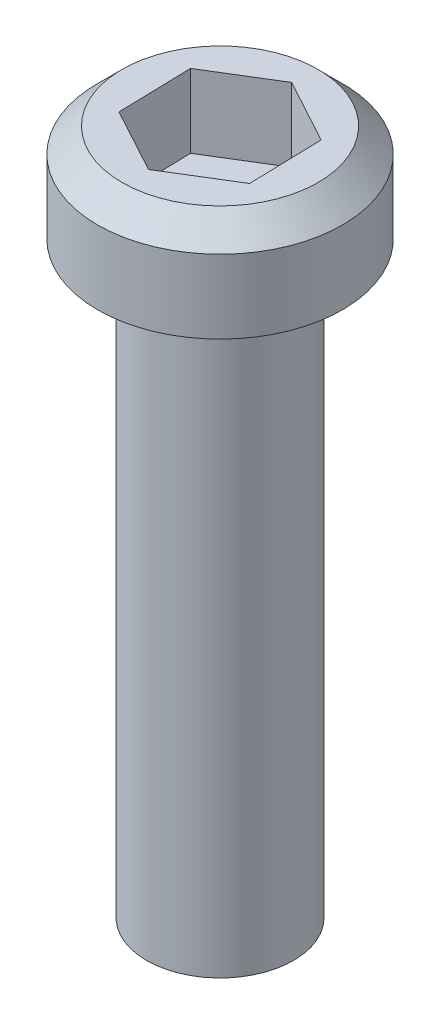
ISO-10303-21;
HEADER;
FILE_DESCRIPTION(('STEP AP214'),'2;1');
FILE_NAME('part.step','',(''),(''),'','','');
FILE_SCHEMA(('AUTOMOTIVE_DESIGN { 1 0 10303 214 1 1 1 1 }'));
ENDSEC;
DATA;
#1=APPLICATION_CONTEXT('core data for automotive mechanical design processes');
#2=APPLICATION_PROTOCOL_DEFINITION('international standard','automotive_design',2000,#1);
#3=PRODUCT_CONTEXT('',#1,'mechanical');
#4=PRODUCT('Part','Part','',(#3));
#5=PRODUCT_RELATED_PRODUCT_CATEGORY('part','',(#4));
#6=PRODUCT_DEFINITION_FORMATION('','',#4);
#7=PRODUCT_DEFINITION_CONTEXT('part definition',#1,'design');
#8=PRODUCT_DEFINITION('design','',#6,#7);
#9=PRODUCT_DEFINITION_SHAPE('','',#8);
#10=(LENGTH_UNIT() NAMED_UNIT(*) SI_UNIT(.MILLI.,.METRE.));
#11=(NAMED_UNIT(*) PLANE_ANGLE_UNIT() SI_UNIT($,.RADIAN.));
#12=(NAMED_UNIT(*) SI_UNIT($,.STERADIAN.) SOLID_ANGLE_UNIT());
#13=UNCERTAINTY_MEASURE_WITH_UNIT(LENGTH_MEASURE(1.E-05),#10,'distance_accuracy_value','');
#14=(GEOMETRIC_REPRESENTATION_CONTEXT(3) GLOBAL_UNCERTAINTY_ASSIGNED_CONTEXT((#13)) GLOBAL_UNIT_ASSIGNED_CONTEXT((#10,
#11,#12)) REPRESENTATION_CONTEXT('',''));
#15=CARTESIAN_POINT('',(0.,0.,0.));
#16=DIRECTION('',(0.,0.,1.));
#17=DIRECTION('',(1.,0.,0.));
#18=AXIS2_PLACEMENT_3D('',#15,#16,#17);
#19=CARTESIAN_POINT('',(-74.5378388677649,-12.,-155.627071659531));
#20=DIRECTION('',(0.,1.,0.));
#21=DIRECTION('',(0.,0.,1.));
#22=AXIS2_PLACEMENT_3D('',#19,#20,#21);
#23=CYLINDRICAL_SURFACE('',#22,1.50000000000001);
#24=CARTESIAN_POINT('',(-74.5378388677649,-12.,-155.627071659531));
#25=DIRECTION('',(0.,1.,0.));
#26=DIRECTION('',(0.,0.,1.));
#27=AXIS2_PLACEMENT_3D('',#24,#25,#26);
#28=CIRCLE('',#27,1.50000000000001);
#29=CARTESIAN_POINT('',(-74.5378388677649,-12.,-154.127071659531));
#30=VERTEX_POINT('',#29);
#31=EDGE_CURVE('E146',#30,#30,#28,.T.);
#32=ORIENTED_EDGE('',*,*,#31,.T.);
#33=EDGE_LOOP('',(#32));
#34=FACE_BOUND('',#33,.T.);
#35=CARTESIAN_POINT('',(-74.5378388677649,0.,-155.627071659531));
#36=DIRECTION('',(0.,1.,0.));
#37=DIRECTION('',(0.,0.,1.));
#38=AXIS2_PLACEMENT_3D('',#35,#36,#37);
#39=CIRCLE('',#38,1.50000000000001);
#40=CARTESIAN_POINT('',(-74.5378388677649,0.,-154.127071659531));
#41=VERTEX_POINT('',#40);
#42=EDGE_CURVE('E145',#41,#41,#39,.T.);
#43=ORIENTED_EDGE('',*,*,#42,.F.);
#44=EDGE_LOOP('',(#43));
#45=FACE_BOUND('',#44,.T.);
#46=ADVANCED_FACE('F34',(#34,#45),#23,.T.);
#47=CARTESIAN_POINT('',(-74.5378388677649,-12.,-155.627071659531));
#48=DIRECTION('',(0.,1.,0.));
#49=DIRECTION('',(0.,0.,1.));
#50=AXIS2_PLACEMENT_3D('',#47,#48,#49);
#51=PLANE('',#50);
#52=ORIENTED_EDGE('',*,*,#31,.F.);
#53=EDGE_LOOP('',(#52));
#54=FACE_BOUND('',#53,.T.);
#55=ADVANCED_FACE('F169',(#54),#51,.F.);
#56=CARTESIAN_POINT('',(-74.5378388677649,2.,-155.627071659531));
#57=DIRECTION('',(0.,-1.,0.));
#58=DIRECTION('',(0.,0.,-1.));
#59=AXIS2_PLACEMENT_3D('',#56,#57,#58);
#60=CYLINDRICAL_SURFACE('',#59,2.50000000000001);
#61=CARTESIAN_POINT('',(-74.5378388677649,1.5,-155.627071659531));
#62=DIRECTION('',(0.,1.,0.));
#63=DIRECTION('',(0.,0.,1.));
#64=AXIS2_PLACEMENT_3D('',#61,#62,#63);
#65=CIRCLE('',#64,2.50000000000001);
#66=CARTESIAN_POINT('',(-74.5378388677649,1.5,-153.127071659531));
#67=VERTEX_POINT('',#66);
#68=EDGE_CURVE('E11',#67,#67,#65,.F.);
#69=ORIENTED_EDGE('',*,*,#68,.T.);
#70=EDGE_LOOP('',(#69));
#71=FACE_BOUND('',#70,.T.);
#72=CARTESIAN_POINT('',(-74.5378388677649,0.,-155.627071659531));
#73=DIRECTION('',(0.,1.,0.));
#74=DIRECTION('',(0.,0.,1.));
#75=AXIS2_PLACEMENT_3D('',#72,#73,#74);
#76=CIRCLE('',#75,2.50000000000001);
#77=CARTESIAN_POINT('',(-74.5378388677649,0.,-153.127071659531));
#78=VERTEX_POINT('',#77);
#79=EDGE_CURVE('E137',#78,#78,#76,.T.);
#80=ORIENTED_EDGE('',*,*,#79,.T.);
#81=EDGE_LOOP('',(#80));
#82=FACE_BOUND('',#81,.T.);
#83=ADVANCED_FACE('F174',(#71,#82),#60,.T.);
#84=CARTESIAN_POINT('',(-74.5378388677649,2.,-155.627071659531));
#85=DIRECTION('',(0.,1.,0.));
#86=DIRECTION('',(0.,0.,1.));
#87=AXIS2_PLACEMENT_3D('',#84,#85,#86);
#88=PLANE('',#87);
#89=DIRECTION('',(0.852695960121091,0.,-0.522407503385213));
#90=VECTOR('',#89,1.);
#91=CARTESIAN_POINT('',(-74.4987335842669,2.,-154.127581487238));
#92=LINE('',#91,#90);
#93=CARTESIAN_POINT('',(-74.4987335842669,2.,-154.127581487238));
#94=VERTEX_POINT('',#93);
#95=CARTESIAN_POINT('',(-73.2196896440853,2.,-154.911192742316));
#96=VERTEX_POINT('',#95);
#97=EDGE_CURVE('E50',#94,#96,#92,.T.);
#98=ORIENTED_EDGE('',*,*,#97,.F.);
#99=DIRECTION('',(0.878766149119737,0.,0.477252611476635));
#100=VECTOR('',#99,1.);
#101=CARTESIAN_POINT('',(-75.8168828079465,2.,-154.843460404453));
#102=LINE('',#101,#100);
#103=CARTESIAN_POINT('',(-75.8168828079465,2.,-154.843460404453));
#104=VERTEX_POINT('',#103);
#105=EDGE_CURVE('E133',#104,#94,#102,.T.);
#106=ORIENTED_EDGE('',*,*,#105,.F.);
#107=DIRECTION('',(0.0260701889986576,0.,0.999660114861834));
#108=VECTOR('',#107,1.);
#109=CARTESIAN_POINT('',(-75.8559880914445,2.,-156.342950576746));
#110=LINE('',#109,#108);
#111=CARTESIAN_POINT('',(-75.8559880914445,2.,-156.342950576746));
#112=VERTEX_POINT('',#111);
#113=EDGE_CURVE('E131',#112,#104,#110,.T.);
#114=ORIENTED_EDGE('',*,*,#113,.F.);
#115=DIRECTION('',(-0.852695960121096,0.,0.522407503385203));
#116=VECTOR('',#115,1.);
#117=CARTESIAN_POINT('',(-74.5769441512629,2.,-157.126561831824));
#118=LINE('',#117,#116);
#119=CARTESIAN_POINT('',(-74.5769441512629,2.,-157.126561831824));
#120=VERTEX_POINT('',#119);
#121=EDGE_CURVE('E98',#120,#112,#118,.T.);
#122=ORIENTED_EDGE('',*,*,#121,.F.);
#123=DIRECTION('',(-0.878766149119749,0.,-0.477252611476613));
#124=VECTOR('',#123,1.);
#125=CARTESIAN_POINT('',(-73.2587949275833,2.,-156.410682914609));
#126=LINE('',#125,#124);
#127=CARTESIAN_POINT('',(-73.2587949275833,2.,-156.410682914609));
#128=VERTEX_POINT('',#127);
#129=EDGE_CURVE('E127',#128,#120,#126,.T.);
#130=ORIENTED_EDGE('',*,*,#129,.F.);
#131=DIRECTION('',(-0.0260701889986484,0.,-0.999660114861834));
#132=VECTOR('',#131,1.);
#133=CARTESIAN_POINT('',(-73.2196896440853,2.,-154.911192742316));
#134=LINE('',#133,#132);
#135=EDGE_CURVE('E124',#96,#128,#134,.T.);
#136=ORIENTED_EDGE('',*,*,#135,.F.);
#137=EDGE_LOOP('',(#98,#106,#114,#122,#130,#136));
#138=FACE_BOUND('',#137,.T.);
#139=CARTESIAN_POINT('',(-74.5378388677649,2.,-155.627071659531));
#140=DIRECTION('',(0.,1.,0.));
#141=DIRECTION('',(0.,0.,1.));
#142=AXIS2_PLACEMENT_3D('',#139,#140,#141);
#143=CIRCLE('',#142,2.);
#144=CARTESIAN_POINT('',(-74.5378388677649,2.,-153.627071659531));
#145=VERTEX_POINT('',#144);
#146=EDGE_CURVE('E43',#145,#145,#143,.T.);
#147=ORIENTED_EDGE('',*,*,#146,.T.);
#148=EDGE_LOOP('',(#147));
#149=FACE_BOUND('',#148,.T.);
#150=ADVANCED_FACE('F153',(#138,#149),#88,.T.);
#151=CARTESIAN_POINT('',(-74.5378388677649,0.,-155.627071659531));
#152=DIRECTION('',(0.,1.,0.));
#153=DIRECTION('',(0.,0.,1.));
#154=AXIS2_PLACEMENT_3D('',#151,#152,#153);
#155=PLANE('',#154);
#156=ORIENTED_EDGE('',*,*,#42,.T.);
#157=EDGE_LOOP('',(#156));
#158=FACE_BOUND('',#157,.T.);
#159=ORIENTED_EDGE('',*,*,#79,.F.);
#160=EDGE_LOOP('',(#159));
#161=FACE_BOUND('',#160,.T.);
#162=ADVANCED_FACE('F157',(#158,#161),#155,.F.);
#163=CARTESIAN_POINT('',(-74.5378388677649,2.,-155.627071659531));
#164=DIRECTION('',(0.,-1.,0.));
#165=DIRECTION('',(0.,0.,-1.));
#166=AXIS2_PLACEMENT_3D('',#163,#164,#165);
#167=CONICAL_SURFACE('',#166,2.,0.785398163397459);
#168=ORIENTED_EDGE('',*,*,#68,.F.);
#169=EDGE_LOOP('',(#168));
#170=FACE_BOUND('',#169,.T.);
#171=ORIENTED_EDGE('',*,*,#146,.F.);
#172=EDGE_LOOP('',(#171));
#173=FACE_BOUND('',#172,.T.);
#174=ADVANCED_FACE('F37',(#170,#173),#167,.T.);
#175=CARTESIAN_POINT('',(-74.4987335842669,0.5,-154.127581487238));
#176=DIRECTION('',(0.522407503385213,0.,0.852695960121091));
#177=DIRECTION('',(0.852695960121091,0.,-0.522407503385213));
#178=AXIS2_PLACEMENT_3D('',#175,#176,#177);
#179=PLANE('',#178);
#180=ORIENTED_EDGE('',*,*,#97,.T.);
#181=DIRECTION('',(0.,1.,0.));
#182=VECTOR('',#181,1.);
#183=CARTESIAN_POINT('',(-73.2196896440853,0.5,-154.911192742316));
#184=LINE('',#183,#182);
#185=CARTESIAN_POINT('',(-73.2196896440853,0.5,-154.911192742316));
#186=VERTEX_POINT('',#185);
#187=EDGE_CURVE('E80',#186,#96,#184,.T.);
#188=ORIENTED_EDGE('',*,*,#187,.F.);
#189=DIRECTION('',(0.852695960121091,0.,-0.522407503385213));
#190=VECTOR('',#189,1.);
#191=CARTESIAN_POINT('',(-74.4987335842669,0.5,-154.127581487238));
#192=LINE('',#191,#190);
#193=CARTESIAN_POINT('',(-74.4987335842669,0.5,-154.127581487238));
#194=VERTEX_POINT('',#193);
#195=EDGE_CURVE('E135',#194,#186,#192,.T.);
#196=ORIENTED_EDGE('',*,*,#195,.F.);
#197=DIRECTION('',(0.,1.,0.));
#198=VECTOR('',#197,1.);
#199=CARTESIAN_POINT('',(-74.4987335842669,0.5,-154.127581487238));
#200=LINE('',#199,#198);
#201=EDGE_CURVE('E58',#194,#94,#200,.T.);
#202=ORIENTED_EDGE('',*,*,#201,.T.);
#203=EDGE_LOOP('',(#180,#188,#196,#202));
#204=FACE_BOUND('',#203,.T.);
#205=ADVANCED_FACE('F156',(#204),#179,.F.);
#206=CARTESIAN_POINT('',(-75.8168828079465,0.5,-154.843460404453));
#207=DIRECTION('',(-0.477252611476635,0.,0.878766149119737));
#208=DIRECTION('',(0.878766149119737,0.,0.477252611476635));
#209=AXIS2_PLACEMENT_3D('',#206,#207,#208);
#210=PLANE('',#209);
#211=ORIENTED_EDGE('',*,*,#105,.T.);
#212=ORIENTED_EDGE('',*,*,#201,.F.);
#213=DIRECTION('',(0.878766149119737,0.,0.477252611476635));
#214=VECTOR('',#213,1.);
#215=CARTESIAN_POINT('',(-75.8168828079465,0.5,-154.843460404453));
#216=LINE('',#215,#214);
#217=CARTESIAN_POINT('',(-75.8168828079465,0.5,-154.843460404453));
#218=VERTEX_POINT('',#217);
#219=EDGE_CURVE('E110',#218,#194,#216,.T.);
#220=ORIENTED_EDGE('',*,*,#219,.F.);
#221=DIRECTION('',(0.,1.,0.));
#222=VECTOR('',#221,1.);
#223=CARTESIAN_POINT('',(-75.8168828079465,0.5,-154.843460404453));
#224=LINE('',#223,#222);
#225=EDGE_CURVE('E102',#218,#104,#224,.T.);
#226=ORIENTED_EDGE('',*,*,#225,.T.);
#227=EDGE_LOOP('',(#211,#212,#220,#226));
#228=FACE_BOUND('',#227,.T.);
#229=ADVANCED_FACE('F163',(#228),#210,.F.);
#230=CARTESIAN_POINT('',(-75.8559880914445,0.5,-156.342950576746));
#231=DIRECTION('',(-0.999660114861834,0.,0.0260701889986576));
#232=DIRECTION('',(0.0260701889986576,0.,0.999660114861834));
#233=AXIS2_PLACEMENT_3D('',#230,#231,#232);
#234=PLANE('',#233);
#235=ORIENTED_EDGE('',*,*,#113,.T.);
#236=ORIENTED_EDGE('',*,*,#225,.F.);
#237=DIRECTION('',(0.0260701889986576,0.,0.999660114861834));
#238=VECTOR('',#237,1.);
#239=CARTESIAN_POINT('',(-75.8559880914445,0.5,-156.342950576746));
#240=LINE('',#239,#238);
#241=CARTESIAN_POINT('',(-75.8559880914445,0.5,-156.342950576746));
#242=VERTEX_POINT('',#241);
#243=EDGE_CURVE('E106',#242,#218,#240,.T.);
#244=ORIENTED_EDGE('',*,*,#243,.F.);
#245=DIRECTION('',(0.,1.,0.));
#246=VECTOR('',#245,1.);
#247=CARTESIAN_POINT('',(-75.8559880914445,0.5,-156.342950576746));
#248=LINE('',#247,#246);
#249=EDGE_CURVE('E91',#242,#112,#248,.T.);
#250=ORIENTED_EDGE('',*,*,#249,.T.);
#251=EDGE_LOOP('',(#235,#236,#244,#250));
#252=FACE_BOUND('',#251,.T.);
#253=ADVANCED_FACE('F107',(#252),#234,.F.);
#254=CARTESIAN_POINT('',(-74.5769441512629,0.5,-157.126561831824));
#255=DIRECTION('',(-0.522407503385204,0.,-0.852695960121096));
#256=DIRECTION('',(-0.852695960121096,0.,0.522407503385204));
#257=AXIS2_PLACEMENT_3D('',#254,#255,#256);
#258=PLANE('',#257);
#259=ORIENTED_EDGE('',*,*,#121,.T.);
#260=ORIENTED_EDGE('',*,*,#249,.F.);
#261=DIRECTION('',(-0.852695960121096,0.,0.522407503385203));
#262=VECTOR('',#261,1.);
#263=CARTESIAN_POINT('',(-74.5769441512629,0.5,-157.126561831824));
#264=LINE('',#263,#262);
#265=CARTESIAN_POINT('',(-74.5769441512629,0.5,-157.126561831824));
#266=VERTEX_POINT('',#265);
#267=EDGE_CURVE('E95',#266,#242,#264,.T.);
#268=ORIENTED_EDGE('',*,*,#267,.F.);
#269=DIRECTION('',(0.,1.,0.));
#270=VECTOR('',#269,1.);
#271=CARTESIAN_POINT('',(-74.5769441512629,0.5,-157.126561831824));
#272=LINE('',#271,#270);
#273=EDGE_CURVE('E103',#266,#120,#272,.T.);
#274=ORIENTED_EDGE('',*,*,#273,.T.);
#275=EDGE_LOOP('',(#259,#260,#268,#274));
#276=FACE_BOUND('',#275,.T.);
#277=ADVANCED_FACE('F93',(#276),#258,.F.);
#278=CARTESIAN_POINT('',(-73.2587949275833,0.5,-156.410682914609));
#279=DIRECTION('',(0.477252611476613,0.,-0.878766149119749));
#280=DIRECTION('',(-0.878766149119749,0.,-0.477252611476613));
#281=AXIS2_PLACEMENT_3D('',#278,#279,#280);
#282=PLANE('',#281);
#283=ORIENTED_EDGE('',*,*,#129,.T.);
#284=ORIENTED_EDGE('',*,*,#273,.F.);
#285=DIRECTION('',(-0.878766149119749,0.,-0.477252611476613));
#286=VECTOR('',#285,1.);
#287=CARTESIAN_POINT('',(-73.2587949275833,0.5,-156.410682914609));
#288=LINE('',#287,#286);
#289=CARTESIAN_POINT('',(-73.2587949275833,0.5,-156.410682914609));
#290=VERTEX_POINT('',#289);
#291=EDGE_CURVE('E116',#290,#266,#288,.T.);
#292=ORIENTED_EDGE('',*,*,#291,.F.);
#293=DIRECTION('',(0.,1.,0.));
#294=VECTOR('',#293,1.);
#295=CARTESIAN_POINT('',(-73.2587949275833,0.5,-156.410682914609));
#296=LINE('',#295,#294);
#297=EDGE_CURVE('E140',#290,#128,#296,.T.);
#298=ORIENTED_EDGE('',*,*,#297,.T.);
#299=EDGE_LOOP('',(#283,#284,#292,#298));
#300=FACE_BOUND('',#299,.T.);
#301=ADVANCED_FACE('F188',(#300),#282,.F.);
#302=CARTESIAN_POINT('',(-73.2196896440853,0.5,-154.911192742316));
#303=DIRECTION('',(0.999660114861834,0.,-0.0260701889986484));
#304=DIRECTION('',(-0.0260701889986484,0.,-0.999660114861834));
#305=AXIS2_PLACEMENT_3D('',#302,#303,#304);
#306=PLANE('',#305);
#307=ORIENTED_EDGE('',*,*,#135,.T.);
#308=ORIENTED_EDGE('',*,*,#297,.F.);
#309=DIRECTION('',(-0.0260701889986484,0.,-0.999660114861834));
#310=VECTOR('',#309,1.);
#311=CARTESIAN_POINT('',(-73.2196896440853,0.5,-154.911192742316));
#312=LINE('',#311,#310);
#313=EDGE_CURVE('E118',#186,#290,#312,.T.);
#314=ORIENTED_EDGE('',*,*,#313,.F.);
#315=ORIENTED_EDGE('',*,*,#187,.T.);
#316=EDGE_LOOP('',(#307,#308,#314,#315));
#317=FACE_BOUND('',#316,.T.);
#318=ADVANCED_FACE('F185',(#317),#306,.F.);
#319=CARTESIAN_POINT('',(0.,0.5,0.));
#320=DIRECTION('',(0.,1.,0.));
#321=DIRECTION('',(0.,0.,1.));
#322=AXIS2_PLACEMENT_3D('',#319,#320,#321);
#323=PLANE('',#322);
#324=ORIENTED_EDGE('',*,*,#195,.T.);
#325=ORIENTED_EDGE('',*,*,#313,.T.);
#326=ORIENTED_EDGE('',*,*,#291,.T.);
#327=ORIENTED_EDGE('',*,*,#267,.T.);
#328=ORIENTED_EDGE('',*,*,#243,.T.);
#329=ORIENTED_EDGE('',*,*,#219,.T.);
#330=EDGE_LOOP('',(#324,#325,#326,#327,#328,#329));
#331=FACE_BOUND('',#330,.T.);
#332=ADVANCED_FACE('F113',(#331),#323,.T.);
#333=CLOSED_SHELL('',(#46,#55,#83,#150,#162,#174,#205,#229,#253,#277,#301,#318,#332));
#334=MANIFOLD_SOLID_BREP('B2',#333);
#335=ADVANCED_BREP_SHAPE_REPRESENTATION('',(#18,#334),#14);
#336=SHAPE_DEFINITION_REPRESENTATION(#9,#335);
ENDSEC;
END-ISO-10303-21;
